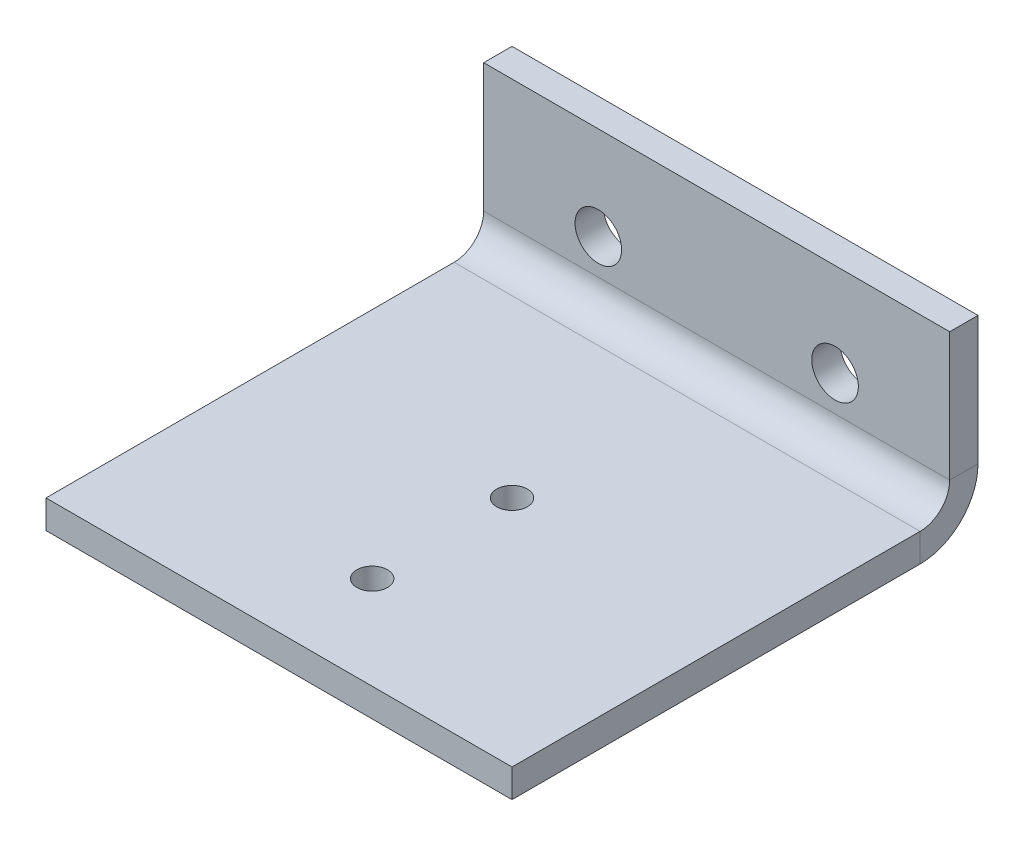
ISO-10303-21;
HEADER;
FILE_DESCRIPTION(('STEP AP214'),'2;1');
FILE_NAME('part.step','',(''),(''),'','','');
FILE_SCHEMA(('AUTOMOTIVE_DESIGN { 1 0 10303 214 1 1 1 1 }'));
ENDSEC;
DATA;
#1=APPLICATION_CONTEXT('core data for automotive mechanical design processes');
#2=APPLICATION_PROTOCOL_DEFINITION('international standard','automotive_design',2000,#1);
#3=PRODUCT_CONTEXT('',#1,'mechanical');
#4=PRODUCT('Part','Part','',(#3));
#5=PRODUCT_RELATED_PRODUCT_CATEGORY('part','',(#4));
#6=PRODUCT_DEFINITION_FORMATION('','',#4);
#7=PRODUCT_DEFINITION_CONTEXT('part definition',#1,'design');
#8=PRODUCT_DEFINITION('design','',#6,#7);
#9=PRODUCT_DEFINITION_SHAPE('','',#8);
#10=(LENGTH_UNIT() NAMED_UNIT(*) SI_UNIT(.MILLI.,.METRE.));
#11=(NAMED_UNIT(*) PLANE_ANGLE_UNIT() SI_UNIT($,.RADIAN.));
#12=(NAMED_UNIT(*) SI_UNIT($,.STERADIAN.) SOLID_ANGLE_UNIT());
#13=UNCERTAINTY_MEASURE_WITH_UNIT(LENGTH_MEASURE(1.E-05),#10,'distance_accuracy_value','');
#14=(GEOMETRIC_REPRESENTATION_CONTEXT(3) GLOBAL_UNCERTAINTY_ASSIGNED_CONTEXT((#13)) GLOBAL_UNIT_ASSIGNED_CONTEXT((#10,
#11,#12)) REPRESENTATION_CONTEXT('',''));
#15=CARTESIAN_POINT('',(0.,0.,0.));
#16=DIRECTION('',(0.,0.,1.));
#17=DIRECTION('',(1.,0.,0.));
#18=AXIS2_PLACEMENT_3D('',#15,#16,#17);
#19=CARTESIAN_POINT('',(25.,10.,-3.03784));
#20=DIRECTION('',(1.,0.,0.));
#21=DIRECTION('',(0.,1.,0.));
#22=AXIS2_PLACEMENT_3D('',#19,#20,#21);
#23=PLANE('',#22);
#24=DIRECTION('',(0.,1.,0.));
#25=VECTOR('',#24,1.);
#26=CARTESIAN_POINT('',(25.,10.,0.));
#27=LINE('',#26,#25);
#28=CARTESIAN_POINT('',(25.,-3.78716000000001,0.));
#29=VERTEX_POINT('',#28);
#30=CARTESIAN_POINT('',(25.,10.,0.));
#31=VERTEX_POINT('',#30);
#32=EDGE_CURVE('E112',#29,#31,#27,.T.);
#33=ORIENTED_EDGE('',*,*,#32,.F.);
#34=DIRECTION('',(0.,0.,-1.));
#35=VECTOR('',#34,1.);
#36=CARTESIAN_POINT('',(25.,-3.78716000000001,0.));
#37=LINE('',#36,#35);
#38=CARTESIAN_POINT('',(25.,-3.78716000000001,-3.03784));
#39=VERTEX_POINT('',#38);
#40=EDGE_CURVE('E142',#29,#39,#37,.T.);
#41=ORIENTED_EDGE('',*,*,#40,.T.);
#42=DIRECTION('',(0.,1.,0.));
#43=VECTOR('',#42,1.);
#44=CARTESIAN_POINT('',(25.,10.,-3.03784));
#45=LINE('',#44,#43);
#46=CARTESIAN_POINT('',(25.,10.,-3.03784));
#47=VERTEX_POINT('',#46);
#48=EDGE_CURVE('E109',#39,#47,#45,.T.);
#49=ORIENTED_EDGE('',*,*,#48,.T.);
#50=DIRECTION('',(0.,0.,1.));
#51=VECTOR('',#50,1.);
#52=CARTESIAN_POINT('',(25.,10.,-3.03784));
#53=LINE('',#52,#51);
#54=EDGE_CURVE('E65',#47,#31,#53,.T.);
#55=ORIENTED_EDGE('',*,*,#54,.T.);
#56=EDGE_LOOP('',(#33,#41,#49,#55));
#57=FACE_BOUND('',#56,.T.);
#58=ADVANCED_FACE('F62',(#57),#23,.T.);
#59=CARTESIAN_POINT('',(0.,0.,-3.03784));
#60=DIRECTION('',(0.,0.,1.));
#61=DIRECTION('',(1.,0.,0.));
#62=AXIS2_PLACEMENT_3D('',#59,#60,#61);
#63=PLANE('',#62);
#64=CARTESIAN_POINT('',(-12.7,0.,-3.03784));
#65=DIRECTION('',(0.,0.,1.));
#66=DIRECTION('',(1.,0.,0.));
#67=AXIS2_PLACEMENT_3D('',#64,#65,#66);
#68=CIRCLE('',#67,2.5);
#69=CARTESIAN_POINT('',(-10.2,0.,-3.03784));
#70=VERTEX_POINT('',#69);
#71=EDGE_CURVE('E117',#70,#70,#68,.T.);
#72=ORIENTED_EDGE('',*,*,#71,.T.);
#73=EDGE_LOOP('',(#72));
#74=FACE_BOUND('',#73,.T.);
#75=CARTESIAN_POINT('',(12.7,0.,-3.03784));
#76=DIRECTION('',(0.,0.,1.));
#77=DIRECTION('',(1.,0.,0.));
#78=AXIS2_PLACEMENT_3D('',#75,#76,#77);
#79=CIRCLE('',#78,2.5);
#80=CARTESIAN_POINT('',(15.2,0.,-3.03784));
#81=VERTEX_POINT('',#80);
#82=EDGE_CURVE('E131',#81,#81,#79,.T.);
#83=ORIENTED_EDGE('',*,*,#82,.T.);
#84=EDGE_LOOP('',(#83));
#85=FACE_BOUND('',#84,.T.);
#86=DIRECTION('',(1.,0.,0.));
#87=VECTOR('',#86,1.);
#88=CARTESIAN_POINT('',(25.,-3.78716000000001,-3.03784));
#89=LINE('',#88,#87);
#90=CARTESIAN_POINT('',(-25.,-3.78715999999999,-3.03784));
#91=VERTEX_POINT('',#90);
#92=EDGE_CURVE('E164',#39,#91,#89,.F.);
#93=ORIENTED_EDGE('',*,*,#92,.T.);
#94=DIRECTION('',(0.,-1.,0.));
#95=VECTOR('',#94,1.);
#96=CARTESIAN_POINT('',(-25.,10.,-3.03784));
#97=LINE('',#96,#95);
#98=CARTESIAN_POINT('',(-25.,10.,-3.03784));
#99=VERTEX_POINT('',#98);
#100=EDGE_CURVE('E120',#99,#91,#97,.T.);
#101=ORIENTED_EDGE('',*,*,#100,.F.);
#102=DIRECTION('',(-1.,0.,0.));
#103=VECTOR('',#102,1.);
#104=CARTESIAN_POINT('',(-25.,10.,-3.03784));
#105=LINE('',#104,#103);
#106=EDGE_CURVE('E101',#47,#99,#105,.T.);
#107=ORIENTED_EDGE('',*,*,#106,.F.);
#108=ORIENTED_EDGE('',*,*,#48,.F.);
#109=EDGE_LOOP('',(#93,#101,#107,#108));
#110=FACE_BOUND('',#109,.T.);
#111=ADVANCED_FACE('F283',(#74,#85,#110),#63,.F.);
#112=CARTESIAN_POINT('',(0.,0.,0.));
#113=DIRECTION('',(0.,0.,1.));
#114=DIRECTION('',(1.,0.,0.));
#115=AXIS2_PLACEMENT_3D('',#112,#113,#114);
#116=PLANE('',#115);
#117=CARTESIAN_POINT('',(12.7,0.,0.));
#118=DIRECTION('',(0.,0.,1.));
#119=DIRECTION('',(1.,0.,0.));
#120=AXIS2_PLACEMENT_3D('',#117,#118,#119);
#121=CIRCLE('',#120,2.5);
#122=CARTESIAN_POINT('',(15.2,0.,0.));
#123=VERTEX_POINT('',#122);
#124=EDGE_CURVE('E135',#123,#123,#121,.T.);
#125=ORIENTED_EDGE('',*,*,#124,.F.);
#126=EDGE_LOOP('',(#125));
#127=FACE_BOUND('',#126,.T.);
#128=CARTESIAN_POINT('',(-12.7,0.,0.));
#129=DIRECTION('',(0.,0.,1.));
#130=DIRECTION('',(1.,0.,0.));
#131=AXIS2_PLACEMENT_3D('',#128,#129,#130);
#132=CIRCLE('',#131,2.5);
#133=CARTESIAN_POINT('',(-10.2,0.,0.));
#134=VERTEX_POINT('',#133);
#135=EDGE_CURVE('E127',#134,#134,#132,.T.);
#136=ORIENTED_EDGE('',*,*,#135,.F.);
#137=EDGE_LOOP('',(#136));
#138=FACE_BOUND('',#137,.T.);
#139=DIRECTION('',(0.,-1.,0.));
#140=VECTOR('',#139,1.);
#141=CARTESIAN_POINT('',(-25.,10.,0.));
#142=LINE('',#141,#140);
#143=CARTESIAN_POINT('',(-25.,10.,0.));
#144=VERTEX_POINT('',#143);
#145=CARTESIAN_POINT('',(-25.,-3.78716000000001,0.));
#146=VERTEX_POINT('',#145);
#147=EDGE_CURVE('E103',#144,#146,#142,.T.);
#148=ORIENTED_EDGE('',*,*,#147,.T.);
#149=DIRECTION('',(1.,0.,0.));
#150=VECTOR('',#149,1.);
#151=CARTESIAN_POINT('',(25.,-3.78716000000001,0.));
#152=LINE('',#151,#150);
#153=EDGE_CURVE('E77',#29,#146,#152,.F.);
#154=ORIENTED_EDGE('',*,*,#153,.F.);
#155=ORIENTED_EDGE('',*,*,#32,.T.);
#156=DIRECTION('',(-1.,0.,0.));
#157=VECTOR('',#156,1.);
#158=CARTESIAN_POINT('',(-25.,10.,0.));
#159=LINE('',#158,#157);
#160=EDGE_CURVE('E99',#31,#144,#159,.T.);
#161=ORIENTED_EDGE('',*,*,#160,.T.);
#162=EDGE_LOOP('',(#148,#154,#155,#161));
#163=FACE_BOUND('',#162,.T.);
#164=ADVANCED_FACE('F111',(#127,#138,#163),#116,.T.);
#165=CARTESIAN_POINT('',(-25.,10.,-3.03784));
#166=DIRECTION('',(-1.,0.,0.));
#167=DIRECTION('',(0.,-1.,0.));
#168=AXIS2_PLACEMENT_3D('',#165,#166,#167);
#169=PLANE('',#168);
#170=DIRECTION('',(0.,0.,-1.));
#171=VECTOR('',#170,1.);
#172=CARTESIAN_POINT('',(-25.,-3.78716000000001,0.));
#173=LINE('',#172,#171);
#174=EDGE_CURVE('E107',#146,#91,#173,.T.);
#175=ORIENTED_EDGE('',*,*,#174,.F.);
#176=ORIENTED_EDGE('',*,*,#147,.F.);
#177=DIRECTION('',(0.,0.,1.));
#178=VECTOR('',#177,1.);
#179=CARTESIAN_POINT('',(-25.,10.,-3.03784));
#180=LINE('',#179,#178);
#181=EDGE_CURVE('E13',#99,#144,#180,.T.);
#182=ORIENTED_EDGE('',*,*,#181,.F.);
#183=ORIENTED_EDGE('',*,*,#100,.T.);
#184=EDGE_LOOP('',(#175,#176,#182,#183));
#185=FACE_BOUND('',#184,.T.);
#186=ADVANCED_FACE('F104',(#185),#169,.T.);
#187=CARTESIAN_POINT('',(-25.,10.,-3.03784));
#188=DIRECTION('',(0.,1.,0.));
#189=DIRECTION('',(0.,0.,1.));
#190=AXIS2_PLACEMENT_3D('',#187,#188,#189);
#191=PLANE('',#190);
#192=ORIENTED_EDGE('',*,*,#160,.F.);
#193=ORIENTED_EDGE('',*,*,#54,.F.);
#194=ORIENTED_EDGE('',*,*,#106,.T.);
#195=ORIENTED_EDGE('',*,*,#181,.T.);
#196=EDGE_LOOP('',(#192,#193,#194,#195));
#197=FACE_BOUND('',#196,.T.);
#198=ADVANCED_FACE('F96',(#197),#191,.T.);
#199=CARTESIAN_POINT('',(-12.7,0.,-3.03784));
#200=DIRECTION('',(0.,0.,1.));
#201=DIRECTION('',(1.,0.,0.));
#202=AXIS2_PLACEMENT_3D('',#199,#200,#201);
#203=CYLINDRICAL_SURFACE('',#202,2.5);
#204=ORIENTED_EDGE('',*,*,#71,.F.);
#205=EDGE_LOOP('',(#204));
#206=FACE_BOUND('',#205,.T.);
#207=ORIENTED_EDGE('',*,*,#135,.T.);
#208=EDGE_LOOP('',(#207));
#209=FACE_BOUND('',#208,.T.);
#210=ADVANCED_FACE('F433',(#206,#209),#203,.F.);
#211=CARTESIAN_POINT('',(12.7,0.,-3.03784));
#212=DIRECTION('',(0.,0.,1.));
#213=DIRECTION('',(1.,0.,0.));
#214=AXIS2_PLACEMENT_3D('',#211,#212,#213);
#215=CYLINDRICAL_SURFACE('',#214,2.5);
#216=ORIENTED_EDGE('',*,*,#82,.F.);
#217=EDGE_LOOP('',(#216));
#218=FACE_BOUND('',#217,.T.);
#219=ORIENTED_EDGE('',*,*,#124,.T.);
#220=EDGE_LOOP('',(#219));
#221=FACE_BOUND('',#220,.T.);
#222=ADVANCED_FACE('F392',(#218,#221),#215,.F.);
#223=CARTESIAN_POINT('',(-25.,-3.78716000000001,3.175));
#224=DIRECTION('',(-1.,0.,0.));
#225=DIRECTION('',(0.,-1.,0.));
#226=AXIS2_PLACEMENT_3D('',#223,#224,#225);
#227=PLANE('',#226);
#228=DIRECTION('',(0.,1.,0.));
#229=VECTOR('',#228,1.);
#230=CARTESIAN_POINT('',(-25.,-10.,3.17499999999998));
#231=LINE('',#230,#229);
#232=CARTESIAN_POINT('',(-25.,-6.96216000000001,3.17499999999999));
#233=VERTEX_POINT('',#232);
#234=CARTESIAN_POINT('',(-25.,-10.,3.17499999999998));
#235=VERTEX_POINT('',#234);
#236=EDGE_CURVE('E171',#233,#235,#231,.F.);
#237=ORIENTED_EDGE('',*,*,#236,.F.);
#238=CARTESIAN_POINT('',(-25.,-3.78716000000001,3.175));
#239=DIRECTION('',(1.,0.,0.));
#240=DIRECTION('',(0.,1.,0.));
#241=AXIS2_PLACEMENT_3D('',#238,#239,#240);
#242=CIRCLE('',#241,3.175);
#243=EDGE_CURVE('E156',#146,#233,#242,.F.);
#244=ORIENTED_EDGE('',*,*,#243,.F.);
#245=ORIENTED_EDGE('',*,*,#174,.T.);
#246=CARTESIAN_POINT('',(-25.,-3.78716000000001,3.175));
#247=DIRECTION('',(1.,0.,0.));
#248=DIRECTION('',(0.,1.,0.));
#249=AXIS2_PLACEMENT_3D('',#246,#247,#248);
#250=CIRCLE('',#249,6.21284);
#251=EDGE_CURVE('E146',#91,#235,#250,.F.);
#252=ORIENTED_EDGE('',*,*,#251,.T.);
#253=EDGE_LOOP('',(#237,#244,#245,#252));
#254=FACE_BOUND('',#253,.T.);
#255=ADVANCED_FACE('F286',(#254),#227,.T.);
#256=CARTESIAN_POINT('',(25.,-3.78716000000001,3.175));
#257=DIRECTION('',(-1.,0.,0.));
#258=DIRECTION('',(0.,-1.,0.));
#259=AXIS2_PLACEMENT_3D('',#256,#257,#258);
#260=PLANE('',#259);
#261=CARTESIAN_POINT('',(25.,-3.78716000000001,3.175));
#262=DIRECTION('',(1.,0.,0.));
#263=DIRECTION('',(0.,1.,0.));
#264=AXIS2_PLACEMENT_3D('',#261,#262,#263);
#265=CIRCLE('',#264,3.175);
#266=CARTESIAN_POINT('',(25.,-6.96216000000001,3.17499999999999));
#267=VERTEX_POINT('',#266);
#268=EDGE_CURVE('E149',#267,#29,#265,.T.);
#269=ORIENTED_EDGE('',*,*,#268,.F.);
#270=DIRECTION('',(0.,1.,0.));
#271=VECTOR('',#270,1.);
#272=CARTESIAN_POINT('',(25.,-6.96216000000001,3.17499999999999));
#273=LINE('',#272,#271);
#274=CARTESIAN_POINT('',(25.,-10.,3.17499999999998));
#275=VERTEX_POINT('',#274);
#276=EDGE_CURVE('E180',#267,#275,#273,.F.);
#277=ORIENTED_EDGE('',*,*,#276,.T.);
#278=CARTESIAN_POINT('',(25.,-3.78716000000001,3.175));
#279=DIRECTION('',(1.,0.,0.));
#280=DIRECTION('',(0.,1.,0.));
#281=AXIS2_PLACEMENT_3D('',#278,#279,#280);
#282=CIRCLE('',#281,6.21284);
#283=EDGE_CURVE('E160',#275,#39,#282,.T.);
#284=ORIENTED_EDGE('',*,*,#283,.T.);
#285=ORIENTED_EDGE('',*,*,#40,.F.);
#286=EDGE_LOOP('',(#269,#277,#284,#285));
#287=FACE_BOUND('',#286,.T.);
#288=ADVANCED_FACE('F290',(#287),#260,.F.);
#289=CARTESIAN_POINT('',(25.,-3.78716000000001,3.175));
#290=DIRECTION('',(1.,0.,0.));
#291=DIRECTION('',(0.,-1.,0.));
#292=AXIS2_PLACEMENT_3D('',#289,#290,#291);
#293=CYLINDRICAL_SURFACE('',#292,6.21284);
#294=ORIENTED_EDGE('',*,*,#92,.F.);
#295=ORIENTED_EDGE('',*,*,#283,.F.);
#296=DIRECTION('',(1.,0.,0.));
#297=VECTOR('',#296,1.);
#298=CARTESIAN_POINT('',(-25.,-10.,3.17499999999998));
#299=LINE('',#298,#297);
#300=EDGE_CURVE('E184',#275,#235,#299,.F.);
#301=ORIENTED_EDGE('',*,*,#300,.T.);
#302=ORIENTED_EDGE('',*,*,#251,.F.);
#303=EDGE_LOOP('',(#294,#295,#301,#302));
#304=FACE_BOUND('',#303,.T.);
#305=ADVANCED_FACE('F287',(#304),#293,.T.);
#306=CARTESIAN_POINT('',(25.,-3.78716000000001,3.175));
#307=DIRECTION('',(1.,0.,0.));
#308=DIRECTION('',(0.,-1.,0.));
#309=AXIS2_PLACEMENT_3D('',#306,#307,#308);
#310=CYLINDRICAL_SURFACE('',#309,3.175);
#311=ORIENTED_EDGE('',*,*,#153,.T.);
#312=ORIENTED_EDGE('',*,*,#243,.T.);
#313=DIRECTION('',(1.,0.,0.));
#314=VECTOR('',#313,1.);
#315=CARTESIAN_POINT('',(-25.,-6.96216000000001,3.17499999999999));
#316=LINE('',#315,#314);
#317=EDGE_CURVE('E175',#233,#267,#316,.T.);
#318=ORIENTED_EDGE('',*,*,#317,.T.);
#319=ORIENTED_EDGE('',*,*,#268,.T.);
#320=EDGE_LOOP('',(#311,#312,#318,#319));
#321=FACE_BOUND('',#320,.T.);
#322=ADVANCED_FACE('F289',(#321),#310,.F.);
#323=CARTESIAN_POINT('',(-25.,-10.,0.));
#324=DIRECTION('',(1.,0.,0.));
#325=DIRECTION('',(0.,0.,-1.));
#326=AXIS2_PLACEMENT_3D('',#323,#324,#325);
#327=PLANE('',#326);
#328=ORIENTED_EDGE('',*,*,#236,.T.);
#329=DIRECTION('',(0.,0.,-1.));
#330=VECTOR('',#329,1.);
#331=CARTESIAN_POINT('',(-25.,-10.,0.));
#332=LINE('',#331,#330);
#333=CARTESIAN_POINT('',(-25.,-10.0000000000002,46.96216));
#334=VERTEX_POINT('',#333);
#335=EDGE_CURVE('E200',#334,#235,#332,.T.);
#336=ORIENTED_EDGE('',*,*,#335,.F.);
#337=DIRECTION('',(0.,1.,0.));
#338=VECTOR('',#337,1.);
#339=CARTESIAN_POINT('',(-25.,-10.0000000000002,46.96216));
#340=LINE('',#339,#338);
#341=CARTESIAN_POINT('',(-25.,-6.96216000000016,46.96216));
#342=VERTEX_POINT('',#341);
#343=EDGE_CURVE('E212',#334,#342,#340,.T.);
#344=ORIENTED_EDGE('',*,*,#343,.T.);
#345=DIRECTION('',(0.,0.,1.));
#346=VECTOR('',#345,1.);
#347=CARTESIAN_POINT('',(-25.,-6.96216,0.));
#348=LINE('',#347,#346);
#349=EDGE_CURVE('E188',#342,#233,#348,.F.);
#350=ORIENTED_EDGE('',*,*,#349,.T.);
#351=EDGE_LOOP('',(#328,#336,#344,#350));
#352=FACE_BOUND('',#351,.T.);
#353=ADVANCED_FACE('F296',(#352),#327,.F.);
#354=CARTESIAN_POINT('',(25.,-10.0000000000002,46.96216));
#355=DIRECTION('',(-1.,0.,0.));
#356=DIRECTION('',(0.,0.,1.));
#357=AXIS2_PLACEMENT_3D('',#354,#355,#356);
#358=PLANE('',#357);
#359=ORIENTED_EDGE('',*,*,#276,.F.);
#360=DIRECTION('',(0.,0.,-1.));
#361=VECTOR('',#360,1.);
#362=CARTESIAN_POINT('',(25.,-6.96216000000016,46.96216));
#363=LINE('',#362,#361);
#364=CARTESIAN_POINT('',(25.,-6.96216000000016,46.96216));
#365=VERTEX_POINT('',#364);
#366=EDGE_CURVE('E192',#267,#365,#363,.F.);
#367=ORIENTED_EDGE('',*,*,#366,.T.);
#368=DIRECTION('',(0.,1.,0.));
#369=VECTOR('',#368,1.);
#370=CARTESIAN_POINT('',(25.,-10.0000000000002,46.96216));
#371=LINE('',#370,#369);
#372=CARTESIAN_POINT('',(25.,-10.0000000000002,46.96216));
#373=VERTEX_POINT('',#372);
#374=EDGE_CURVE('E153',#373,#365,#371,.T.);
#375=ORIENTED_EDGE('',*,*,#374,.F.);
#376=DIRECTION('',(0.,0.,1.));
#377=VECTOR('',#376,1.);
#378=CARTESIAN_POINT('',(25.,-10.,0.));
#379=LINE('',#378,#377);
#380=EDGE_CURVE('E204',#275,#373,#379,.T.);
#381=ORIENTED_EDGE('',*,*,#380,.F.);
#382=EDGE_LOOP('',(#359,#367,#375,#381));
#383=FACE_BOUND('',#382,.T.);
#384=ADVANCED_FACE('F241',(#383),#358,.F.);
#385=CARTESIAN_POINT('',(0.,-10.,0.));
#386=DIRECTION('',(0.,1.,0.));
#387=DIRECTION('',(0.,0.,1.));
#388=AXIS2_PLACEMENT_3D('',#385,#386,#387);
#389=PLANE('',#388);
#390=CARTESIAN_POINT('',(0.,-10.0000000000001,36.96216));
#391=DIRECTION('',(0.,-1.,0.));
#392=DIRECTION('',(0.,0.,-1.));
#393=AXIS2_PLACEMENT_3D('',#390,#391,#392);
#394=CIRCLE('',#393,1.65);
#395=CARTESIAN_POINT('',(0.,-10.0000000000001,35.31216));
#396=VERTEX_POINT('',#395);
#397=EDGE_CURVE('E176',#396,#396,#394,.T.);
#398=ORIENTED_EDGE('',*,*,#397,.F.);
#399=EDGE_LOOP('',(#398));
#400=FACE_BOUND('',#399,.T.);
#401=CARTESIAN_POINT('',(0.,-10.0000000000001,21.96216));
#402=DIRECTION('',(0.,-1.,0.));
#403=DIRECTION('',(0.,0.,-1.));
#404=AXIS2_PLACEMENT_3D('',#401,#402,#403);
#405=CIRCLE('',#404,1.65);
#406=CARTESIAN_POINT('',(0.,-10.0000000000001,20.31216));
#407=VERTEX_POINT('',#406);
#408=EDGE_CURVE('E223',#407,#407,#405,.T.);
#409=ORIENTED_EDGE('',*,*,#408,.F.);
#410=EDGE_LOOP('',(#409));
#411=FACE_BOUND('',#410,.T.);
#412=ORIENTED_EDGE('',*,*,#300,.F.);
#413=ORIENTED_EDGE('',*,*,#380,.T.);
#414=DIRECTION('',(-1.,0.,0.));
#415=VECTOR('',#414,1.);
#416=CARTESIAN_POINT('',(0.,-10.0000000000002,46.96216));
#417=LINE('',#416,#415);
#418=EDGE_CURVE('E208',#373,#334,#417,.T.);
#419=ORIENTED_EDGE('',*,*,#418,.T.);
#420=ORIENTED_EDGE('',*,*,#335,.T.);
#421=EDGE_LOOP('',(#412,#413,#419,#420));
#422=FACE_BOUND('',#421,.T.);
#423=ADVANCED_FACE('F237',(#400,#411,#422),#389,.F.);
#424=CARTESIAN_POINT('',(0.,-6.96216,0.));
#425=DIRECTION('',(0.,1.,0.));
#426=DIRECTION('',(0.,0.,1.));
#427=AXIS2_PLACEMENT_3D('',#424,#425,#426);
#428=PLANE('',#427);
#429=CARTESIAN_POINT('',(0.,-6.96216000000013,36.96216));
#430=DIRECTION('',(0.,1.,0.));
#431=DIRECTION('',(0.,0.,1.));
#432=AXIS2_PLACEMENT_3D('',#429,#430,#431);
#433=CIRCLE('',#432,1.65);
#434=CARTESIAN_POINT('',(0.,-6.96216000000013,38.61216));
#435=VERTEX_POINT('',#434);
#436=EDGE_CURVE('E227',#435,#435,#433,.F.);
#437=ORIENTED_EDGE('',*,*,#436,.T.);
#438=EDGE_LOOP('',(#437));
#439=FACE_BOUND('',#438,.T.);
#440=CARTESIAN_POINT('',(0.,-6.96216000000007,21.96216));
#441=DIRECTION('',(0.,1.,0.));
#442=DIRECTION('',(0.,0.,1.));
#443=AXIS2_PLACEMENT_3D('',#440,#441,#442);
#444=CIRCLE('',#443,1.65);
#445=CARTESIAN_POINT('',(0.,-6.96216000000008,23.61216));
#446=VERTEX_POINT('',#445);
#447=EDGE_CURVE('E219',#446,#446,#444,.F.);
#448=ORIENTED_EDGE('',*,*,#447,.T.);
#449=EDGE_LOOP('',(#448));
#450=FACE_BOUND('',#449,.T.);
#451=ORIENTED_EDGE('',*,*,#366,.F.);
#452=ORIENTED_EDGE('',*,*,#317,.F.);
#453=ORIENTED_EDGE('',*,*,#349,.F.);
#454=DIRECTION('',(1.,0.,0.));
#455=VECTOR('',#454,1.);
#456=CARTESIAN_POINT('',(-25.,-6.96216000000016,46.96216));
#457=LINE('',#456,#455);
#458=EDGE_CURVE('E196',#365,#342,#457,.F.);
#459=ORIENTED_EDGE('',*,*,#458,.F.);
#460=EDGE_LOOP('',(#451,#452,#453,#459));
#461=FACE_BOUND('',#460,.T.);
#462=ADVANCED_FACE('F240',(#439,#450,#461),#428,.T.);
#463=CARTESIAN_POINT('',(-25.,-10.0000000000002,46.96216));
#464=DIRECTION('',(0.,0.,-1.));
#465=DIRECTION('',(0.,1.,0.));
#466=AXIS2_PLACEMENT_3D('',#463,#464,#465);
#467=PLANE('',#466);
#468=ORIENTED_EDGE('',*,*,#458,.T.);
#469=ORIENTED_EDGE('',*,*,#343,.F.);
#470=ORIENTED_EDGE('',*,*,#418,.F.);
#471=ORIENTED_EDGE('',*,*,#374,.T.);
#472=EDGE_LOOP('',(#468,#469,#470,#471));
#473=FACE_BOUND('',#472,.T.);
#474=ADVANCED_FACE('F268',(#473),#467,.F.);
#475=CARTESIAN_POINT('',(0.,10.0010000000001,21.9621600000001));
#476=DIRECTION('',(0.,-1.,0.));
#477=DIRECTION('',(0.,0.,-1.));
#478=AXIS2_PLACEMENT_3D('',#475,#476,#477);
#479=CYLINDRICAL_SURFACE('',#478,1.65);
#480=ORIENTED_EDGE('',*,*,#447,.F.);
#481=EDGE_LOOP('',(#480));
#482=FACE_BOUND('',#481,.T.);
#483=ORIENTED_EDGE('',*,*,#408,.T.);
#484=EDGE_LOOP('',(#483));
#485=FACE_BOUND('',#484,.T.);
#486=ADVANCED_FACE('F323',(#482,#485),#479,.F.);
#487=CARTESIAN_POINT('',(0.,10.001,36.9621600000001));
#488=DIRECTION('',(0.,-1.,0.));
#489=DIRECTION('',(0.,0.,-1.));
#490=AXIS2_PLACEMENT_3D('',#487,#488,#489);
#491=CYLINDRICAL_SURFACE('',#490,1.65);
#492=ORIENTED_EDGE('',*,*,#436,.F.);
#493=EDGE_LOOP('',(#492));
#494=FACE_BOUND('',#493,.T.);
#495=ORIENTED_EDGE('',*,*,#397,.T.);
#496=EDGE_LOOP('',(#495));
#497=FACE_BOUND('',#496,.T.);
#498=ADVANCED_FACE('F235',(#494,#497),#491,.F.);
#499=CLOSED_SHELL('',(#58,#111,#164,#186,#198,#210,#222,#255,#288,#305,#322,#353,#384,#423,#462,
#474,#486,#498));
#500=MANIFOLD_SOLID_BREP('B2',#499);
#501=ADVANCED_BREP_SHAPE_REPRESENTATION('',(#18,#500),#14);
#502=SHAPE_DEFINITION_REPRESENTATION(#9,#501);
ENDSEC;
END-ISO-10303-21;
